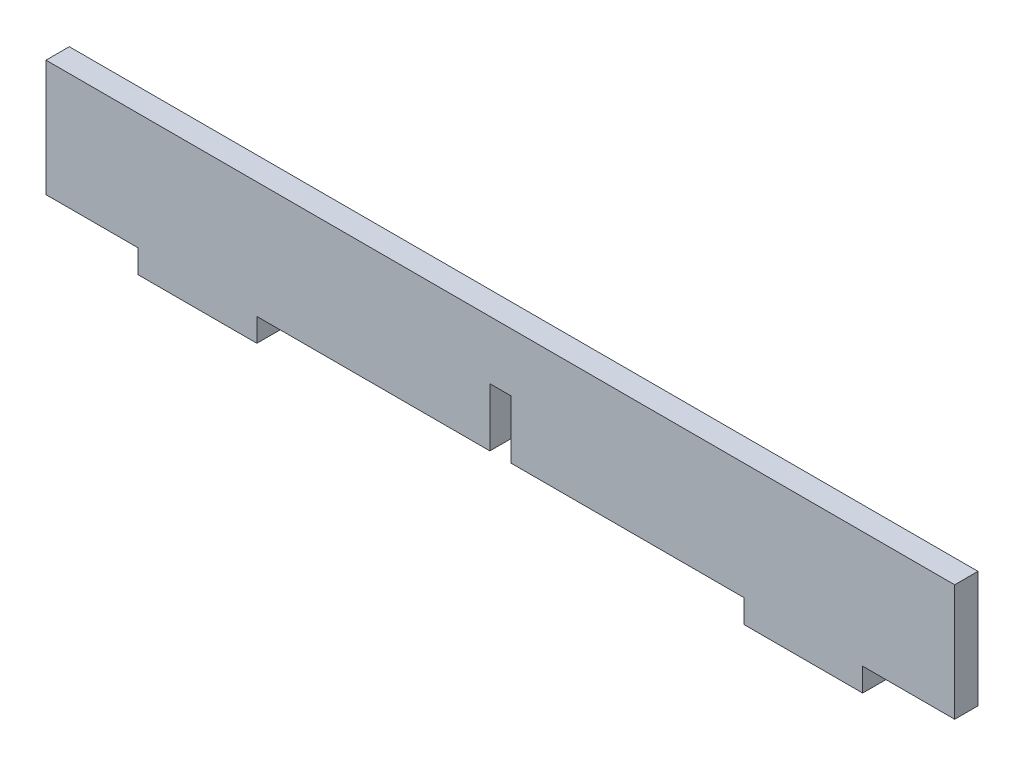
ISO-10303-21;
HEADER;
FILE_DESCRIPTION(('STEP AP214'),'2;1');
FILE_NAME('part.step','',(''),(''),'','','');
FILE_SCHEMA(('AUTOMOTIVE_DESIGN { 1 0 10303 214 1 1 1 1 }'));
ENDSEC;
DATA;
#1=APPLICATION_CONTEXT('core data for automotive mechanical design processes');
#2=APPLICATION_PROTOCOL_DEFINITION('international standard','automotive_design',2000,#1);
#3=PRODUCT_CONTEXT('',#1,'mechanical');
#4=PRODUCT('Part','Part','',(#3));
#5=PRODUCT_RELATED_PRODUCT_CATEGORY('part','',(#4));
#6=PRODUCT_DEFINITION_FORMATION('','',#4);
#7=PRODUCT_DEFINITION_CONTEXT('part definition',#1,'design');
#8=PRODUCT_DEFINITION('design','',#6,#7);
#9=PRODUCT_DEFINITION_SHAPE('','',#8);
#10=(LENGTH_UNIT() NAMED_UNIT(*) SI_UNIT(.MILLI.,.METRE.));
#11=(NAMED_UNIT(*) PLANE_ANGLE_UNIT() SI_UNIT($,.RADIAN.));
#12=(NAMED_UNIT(*) SI_UNIT($,.STERADIAN.) SOLID_ANGLE_UNIT());
#13=UNCERTAINTY_MEASURE_WITH_UNIT(LENGTH_MEASURE(1.E-05),#10,'distance_accuracy_value','');
#14=(GEOMETRIC_REPRESENTATION_CONTEXT(3) GLOBAL_UNCERTAINTY_ASSIGNED_CONTEXT((#13)) GLOBAL_UNIT_ASSIGNED_CONTEXT((#10,
#11,#12)) REPRESENTATION_CONTEXT('',''));
#15=CARTESIAN_POINT('',(0.,0.,0.));
#16=DIRECTION('',(0.,0.,1.));
#17=DIRECTION('',(1.,0.,0.));
#18=AXIS2_PLACEMENT_3D('',#15,#16,#17);
#19=CARTESIAN_POINT('',(-39.,2.,2.));
#20=DIRECTION('',(1.,0.,0.));
#21=DIRECTION('',(0.,0.,-1.));
#22=AXIS2_PLACEMENT_3D('',#19,#20,#21);
#23=PLANE('',#22);
#24=DIRECTION('',(0.,-1.,0.));
#25=VECTOR('',#24,1.);
#26=CARTESIAN_POINT('',(-39.,2.,0.));
#27=LINE('',#26,#25);
#28=CARTESIAN_POINT('',(-39.,12.,0.));
#29=VERTEX_POINT('',#28);
#30=CARTESIAN_POINT('',(-39.,2.,0.));
#31=VERTEX_POINT('',#30);
#32=EDGE_CURVE('E177',#29,#31,#27,.T.);
#33=ORIENTED_EDGE('',*,*,#32,.T.);
#34=DIRECTION('',(0.,0.,-1.));
#35=VECTOR('',#34,1.);
#36=CARTESIAN_POINT('',(-39.,2.,2.));
#37=LINE('',#36,#35);
#38=CARTESIAN_POINT('',(-39.,2.,2.));
#39=VERTEX_POINT('',#38);
#40=EDGE_CURVE('E11',#39,#31,#37,.T.);
#41=ORIENTED_EDGE('',*,*,#40,.F.);
#42=DIRECTION('',(0.,-1.,0.));
#43=VECTOR('',#42,1.);
#44=CARTESIAN_POINT('',(-39.,2.,2.));
#45=LINE('',#44,#43);
#46=CARTESIAN_POINT('',(-39.,12.,2.));
#47=VERTEX_POINT('',#46);
#48=EDGE_CURVE('E207',#47,#39,#45,.T.);
#49=ORIENTED_EDGE('',*,*,#48,.F.);
#50=DIRECTION('',(0.,0.,-1.));
#51=VECTOR('',#50,1.);
#52=CARTESIAN_POINT('',(-39.,12.,2.));
#53=LINE('',#52,#51);
#54=EDGE_CURVE('E173',#47,#29,#53,.T.);
#55=ORIENTED_EDGE('',*,*,#54,.T.);
#56=EDGE_LOOP('',(#33,#41,#49,#55));
#57=FACE_BOUND('',#56,.T.);
#58=ADVANCED_FACE('F33',(#57),#23,.F.);
#59=CARTESIAN_POINT('',(-39.,2.,2.));
#60=DIRECTION('',(0.,1.,0.));
#61=DIRECTION('',(-1.,0.,0.));
#62=AXIS2_PLACEMENT_3D('',#59,#60,#61);
#63=PLANE('',#62);
#64=DIRECTION('',(1.,0.,0.));
#65=VECTOR('',#64,1.);
#66=CARTESIAN_POINT('',(-39.,2.,0.));
#67=LINE('',#66,#65);
#68=CARTESIAN_POINT('',(-31.1,2.,0.));
#69=VERTEX_POINT('',#68);
#70=EDGE_CURVE('E180',#31,#69,#67,.T.);
#71=ORIENTED_EDGE('',*,*,#70,.T.);
#72=DIRECTION('',(0.,0.,-1.));
#73=VECTOR('',#72,1.);
#74=CARTESIAN_POINT('',(-31.1,2.,2.));
#75=LINE('',#74,#73);
#76=CARTESIAN_POINT('',(-31.1,2.,2.));
#77=VERTEX_POINT('',#76);
#78=EDGE_CURVE('E41',#77,#69,#75,.T.);
#79=ORIENTED_EDGE('',*,*,#78,.F.);
#80=DIRECTION('',(1.,0.,0.));
#81=VECTOR('',#80,1.);
#82=CARTESIAN_POINT('',(-39.,2.,2.));
#83=LINE('',#82,#81);
#84=EDGE_CURVE('E116',#39,#77,#83,.T.);
#85=ORIENTED_EDGE('',*,*,#84,.F.);
#86=ORIENTED_EDGE('',*,*,#40,.T.);
#87=EDGE_LOOP('',(#71,#79,#85,#86));
#88=FACE_BOUND('',#87,.T.);
#89=ADVANCED_FACE('F305',(#88),#63,.F.);
#90=CARTESIAN_POINT('',(-31.1,2.,2.));
#91=DIRECTION('',(1.,0.,0.));
#92=DIRECTION('',(0.,0.,-1.));
#93=AXIS2_PLACEMENT_3D('',#90,#91,#92);
#94=PLANE('',#93);
#95=DIRECTION('',(0.,-1.,0.));
#96=VECTOR('',#95,1.);
#97=CARTESIAN_POINT('',(-31.1,2.,0.));
#98=LINE('',#97,#96);
#99=CARTESIAN_POINT('',(-31.1,0.,0.));
#100=VERTEX_POINT('',#99);
#101=EDGE_CURVE('E182',#69,#100,#98,.T.);
#102=ORIENTED_EDGE('',*,*,#101,.T.);
#103=DIRECTION('',(0.,0.,-1.));
#104=VECTOR('',#103,1.);
#105=CARTESIAN_POINT('',(-31.1,0.,2.));
#106=LINE('',#105,#104);
#107=CARTESIAN_POINT('',(-31.1,0.,2.));
#108=VERTEX_POINT('',#107);
#109=EDGE_CURVE('E238',#108,#100,#106,.T.);
#110=ORIENTED_EDGE('',*,*,#109,.F.);
#111=DIRECTION('',(0.,-1.,0.));
#112=VECTOR('',#111,1.);
#113=CARTESIAN_POINT('',(-31.1,2.,2.));
#114=LINE('',#113,#112);
#115=EDGE_CURVE('E246',#77,#108,#114,.T.);
#116=ORIENTED_EDGE('',*,*,#115,.F.);
#117=ORIENTED_EDGE('',*,*,#78,.T.);
#118=EDGE_LOOP('',(#102,#110,#116,#117));
#119=FACE_BOUND('',#118,.T.);
#120=ADVANCED_FACE('F244',(#119),#94,.F.);
#121=CARTESIAN_POINT('',(-20.9,0.,2.));
#122=DIRECTION('',(0.,1.,0.));
#123=DIRECTION('',(-1.,0.,0.));
#124=AXIS2_PLACEMENT_3D('',#121,#122,#123);
#125=PLANE('',#124);
#126=DIRECTION('',(1.,0.,0.));
#127=VECTOR('',#126,1.);
#128=CARTESIAN_POINT('',(-20.9,0.,0.));
#129=LINE('',#128,#127);
#130=CARTESIAN_POINT('',(-20.9,0.,0.));
#131=VERTEX_POINT('',#130);
#132=EDGE_CURVE('E184',#100,#131,#129,.T.);
#133=ORIENTED_EDGE('',*,*,#132,.T.);
#134=DIRECTION('',(0.,0.,-1.));
#135=VECTOR('',#134,1.);
#136=CARTESIAN_POINT('',(-20.9,0.,2.));
#137=LINE('',#136,#135);
#138=CARTESIAN_POINT('',(-20.9,0.,2.));
#139=VERTEX_POINT('',#138);
#140=EDGE_CURVE('E235',#139,#131,#137,.T.);
#141=ORIENTED_EDGE('',*,*,#140,.F.);
#142=DIRECTION('',(1.,0.,0.));
#143=VECTOR('',#142,1.);
#144=CARTESIAN_POINT('',(-20.9,0.,2.));
#145=LINE('',#144,#143);
#146=EDGE_CURVE('E264',#108,#139,#145,.T.);
#147=ORIENTED_EDGE('',*,*,#146,.F.);
#148=ORIENTED_EDGE('',*,*,#109,.T.);
#149=EDGE_LOOP('',(#133,#141,#147,#148));
#150=FACE_BOUND('',#149,.T.);
#151=ADVANCED_FACE('F255',(#150),#125,.F.);
#152=CARTESIAN_POINT('',(-20.9,2.,2.));
#153=DIRECTION('',(-1.,0.,0.));
#154=DIRECTION('',(0.,0.,1.));
#155=AXIS2_PLACEMENT_3D('',#152,#153,#154);
#156=PLANE('',#155);
#157=DIRECTION('',(0.,1.,0.));
#158=VECTOR('',#157,1.);
#159=CARTESIAN_POINT('',(-20.9,2.,0.));
#160=LINE('',#159,#158);
#161=CARTESIAN_POINT('',(-20.9,2.,0.));
#162=VERTEX_POINT('',#161);
#163=EDGE_CURVE('E186',#131,#162,#160,.T.);
#164=ORIENTED_EDGE('',*,*,#163,.T.);
#165=DIRECTION('',(0.,0.,-1.));
#166=VECTOR('',#165,1.);
#167=CARTESIAN_POINT('',(-20.9,2.,2.));
#168=LINE('',#167,#166);
#169=CARTESIAN_POINT('',(-20.9,2.,2.));
#170=VERTEX_POINT('',#169);
#171=EDGE_CURVE('E232',#170,#162,#168,.T.);
#172=ORIENTED_EDGE('',*,*,#171,.F.);
#173=DIRECTION('',(0.,1.,0.));
#174=VECTOR('',#173,1.);
#175=CARTESIAN_POINT('',(-20.9,2.,2.));
#176=LINE('',#175,#174);
#177=EDGE_CURVE('E261',#139,#170,#176,.T.);
#178=ORIENTED_EDGE('',*,*,#177,.F.);
#179=ORIENTED_EDGE('',*,*,#140,.T.);
#180=EDGE_LOOP('',(#164,#172,#178,#179));
#181=FACE_BOUND('',#180,.T.);
#182=ADVANCED_FACE('F259',(#181),#156,.F.);
#183=CARTESIAN_POINT('',(-20.9,2.,2.));
#184=DIRECTION('',(0.,1.,0.));
#185=DIRECTION('',(0.,0.,1.));
#186=AXIS2_PLACEMENT_3D('',#183,#184,#185);
#187=PLANE('',#186);
#188=DIRECTION('',(1.,0.,0.));
#189=VECTOR('',#188,1.);
#190=CARTESIAN_POINT('',(-20.9,2.,0.));
#191=LINE('',#190,#189);
#192=CARTESIAN_POINT('',(-0.9,2.,0.));
#193=VERTEX_POINT('',#192);
#194=EDGE_CURVE('E188',#162,#193,#191,.T.);
#195=ORIENTED_EDGE('',*,*,#194,.T.);
#196=DIRECTION('',(0.,0.,-1.));
#197=VECTOR('',#196,1.);
#198=CARTESIAN_POINT('',(-0.9,2.,2.));
#199=LINE('',#198,#197);
#200=CARTESIAN_POINT('',(-0.9,2.,2.));
#201=VERTEX_POINT('',#200);
#202=EDGE_CURVE('E229',#201,#193,#199,.T.);
#203=ORIENTED_EDGE('',*,*,#202,.F.);
#204=DIRECTION('',(1.,0.,0.));
#205=VECTOR('',#204,1.);
#206=CARTESIAN_POINT('',(-20.9,2.,2.));
#207=LINE('',#206,#205);
#208=EDGE_CURVE('E263',#170,#201,#207,.T.);
#209=ORIENTED_EDGE('',*,*,#208,.F.);
#210=ORIENTED_EDGE('',*,*,#171,.T.);
#211=EDGE_LOOP('',(#195,#203,#209,#210));
#212=FACE_BOUND('',#211,.T.);
#213=ADVANCED_FACE('F318',(#212),#187,.F.);
#214=CARTESIAN_POINT('',(-0.9,2.,2.));
#215=DIRECTION('',(-1.,0.,0.));
#216=DIRECTION('',(0.,0.,1.));
#217=AXIS2_PLACEMENT_3D('',#214,#215,#216);
#218=PLANE('',#217);
#219=DIRECTION('',(0.,1.,0.));
#220=VECTOR('',#219,1.);
#221=CARTESIAN_POINT('',(-0.9,2.,0.));
#222=LINE('',#221,#220);
#223=CARTESIAN_POINT('',(-0.9,6.99999999999999,0.));
#224=VERTEX_POINT('',#223);
#225=EDGE_CURVE('E190',#193,#224,#222,.T.);
#226=ORIENTED_EDGE('',*,*,#225,.T.);
#227=DIRECTION('',(0.,0.,-1.));
#228=VECTOR('',#227,1.);
#229=CARTESIAN_POINT('',(-0.9,6.99999999999999,2.));
#230=LINE('',#229,#228);
#231=CARTESIAN_POINT('',(-0.9,6.99999999999999,2.));
#232=VERTEX_POINT('',#231);
#233=EDGE_CURVE('E226',#232,#224,#230,.T.);
#234=ORIENTED_EDGE('',*,*,#233,.F.);
#235=DIRECTION('',(0.,1.,0.));
#236=VECTOR('',#235,1.);
#237=CARTESIAN_POINT('',(-0.9,2.,2.));
#238=LINE('',#237,#236);
#239=EDGE_CURVE('E266',#201,#232,#238,.T.);
#240=ORIENTED_EDGE('',*,*,#239,.F.);
#241=ORIENTED_EDGE('',*,*,#202,.T.);
#242=EDGE_LOOP('',(#226,#234,#240,#241));
#243=FACE_BOUND('',#242,.T.);
#244=ADVANCED_FACE('F321',(#243),#218,.F.);
#245=CARTESIAN_POINT('',(-0.9,6.99999999999999,2.));
#246=DIRECTION('',(0.,1.,0.));
#247=DIRECTION('',(0.,0.,1.));
#248=AXIS2_PLACEMENT_3D('',#245,#246,#247);
#249=PLANE('',#248);
#250=DIRECTION('',(1.,0.,0.));
#251=VECTOR('',#250,1.);
#252=CARTESIAN_POINT('',(-0.9,6.99999999999999,0.));
#253=LINE('',#252,#251);
#254=CARTESIAN_POINT('',(0.9,6.99999999999999,0.));
#255=VERTEX_POINT('',#254);
#256=EDGE_CURVE('E192',#224,#255,#253,.T.);
#257=ORIENTED_EDGE('',*,*,#256,.T.);
#258=DIRECTION('',(0.,0.,-1.));
#259=VECTOR('',#258,1.);
#260=CARTESIAN_POINT('',(0.9,6.99999999999999,2.));
#261=LINE('',#260,#259);
#262=CARTESIAN_POINT('',(0.9,6.99999999999999,2.));
#263=VERTEX_POINT('',#262);
#264=EDGE_CURVE('E223',#263,#255,#261,.T.);
#265=ORIENTED_EDGE('',*,*,#264,.F.);
#266=DIRECTION('',(1.,0.,0.));
#267=VECTOR('',#266,1.);
#268=CARTESIAN_POINT('',(-0.9,6.99999999999999,2.));
#269=LINE('',#268,#267);
#270=EDGE_CURVE('E272',#232,#263,#269,.T.);
#271=ORIENTED_EDGE('',*,*,#270,.F.);
#272=ORIENTED_EDGE('',*,*,#233,.T.);
#273=EDGE_LOOP('',(#257,#265,#271,#272));
#274=FACE_BOUND('',#273,.T.);
#275=ADVANCED_FACE('F325',(#274),#249,.F.);
#276=CARTESIAN_POINT('',(0.9,2.,2.));
#277=DIRECTION('',(1.,0.,0.));
#278=DIRECTION('',(0.,0.,-1.));
#279=AXIS2_PLACEMENT_3D('',#276,#277,#278);
#280=PLANE('',#279);
#281=DIRECTION('',(0.,-1.,0.));
#282=VECTOR('',#281,1.);
#283=CARTESIAN_POINT('',(0.9,2.,0.));
#284=LINE('',#283,#282);
#285=CARTESIAN_POINT('',(0.9,2.,0.));
#286=VERTEX_POINT('',#285);
#287=EDGE_CURVE('E194',#255,#286,#284,.T.);
#288=ORIENTED_EDGE('',*,*,#287,.T.);
#289=DIRECTION('',(0.,0.,-1.));
#290=VECTOR('',#289,1.);
#291=CARTESIAN_POINT('',(0.9,2.,2.));
#292=LINE('',#291,#290);
#293=CARTESIAN_POINT('',(0.9,2.,2.));
#294=VERTEX_POINT('',#293);
#295=EDGE_CURVE('E220',#294,#286,#292,.T.);
#296=ORIENTED_EDGE('',*,*,#295,.F.);
#297=DIRECTION('',(0.,-1.,0.));
#298=VECTOR('',#297,1.);
#299=CARTESIAN_POINT('',(0.9,2.,2.));
#300=LINE('',#299,#298);
#301=EDGE_CURVE('E274',#263,#294,#300,.T.);
#302=ORIENTED_EDGE('',*,*,#301,.F.);
#303=ORIENTED_EDGE('',*,*,#264,.T.);
#304=EDGE_LOOP('',(#288,#296,#302,#303));
#305=FACE_BOUND('',#304,.T.);
#306=ADVANCED_FACE('F329',(#305),#280,.F.);
#307=CARTESIAN_POINT('',(0.9,2.,2.));
#308=DIRECTION('',(0.,1.,0.));
#309=DIRECTION('',(0.,0.,1.));
#310=AXIS2_PLACEMENT_3D('',#307,#308,#309);
#311=PLANE('',#310);
#312=DIRECTION('',(1.,0.,0.));
#313=VECTOR('',#312,1.);
#314=CARTESIAN_POINT('',(0.9,2.,0.));
#315=LINE('',#314,#313);
#316=CARTESIAN_POINT('',(20.9,2.,0.));
#317=VERTEX_POINT('',#316);
#318=EDGE_CURVE('E196',#286,#317,#315,.T.);
#319=ORIENTED_EDGE('',*,*,#318,.T.);
#320=DIRECTION('',(0.,0.,-1.));
#321=VECTOR('',#320,1.);
#322=CARTESIAN_POINT('',(20.9,2.,2.));
#323=LINE('',#322,#321);
#324=CARTESIAN_POINT('',(20.9,2.,2.));
#325=VERTEX_POINT('',#324);
#326=EDGE_CURVE('E217',#325,#317,#323,.T.);
#327=ORIENTED_EDGE('',*,*,#326,.F.);
#328=DIRECTION('',(1.,0.,0.));
#329=VECTOR('',#328,1.);
#330=CARTESIAN_POINT('',(0.9,2.,2.));
#331=LINE('',#330,#329);
#332=EDGE_CURVE('E276',#294,#325,#331,.T.);
#333=ORIENTED_EDGE('',*,*,#332,.F.);
#334=ORIENTED_EDGE('',*,*,#295,.T.);
#335=EDGE_LOOP('',(#319,#327,#333,#334));
#336=FACE_BOUND('',#335,.T.);
#337=ADVANCED_FACE('F333',(#336),#311,.F.);
#338=CARTESIAN_POINT('',(20.9,2.,2.));
#339=DIRECTION('',(1.,0.,0.));
#340=DIRECTION('',(0.,0.,-1.));
#341=AXIS2_PLACEMENT_3D('',#338,#339,#340);
#342=PLANE('',#341);
#343=DIRECTION('',(0.,-1.,0.));
#344=VECTOR('',#343,1.);
#345=CARTESIAN_POINT('',(20.9,2.,0.));
#346=LINE('',#345,#344);
#347=CARTESIAN_POINT('',(20.9,0.,0.));
#348=VERTEX_POINT('',#347);
#349=EDGE_CURVE('E198',#317,#348,#346,.T.);
#350=ORIENTED_EDGE('',*,*,#349,.T.);
#351=DIRECTION('',(0.,0.,-1.));
#352=VECTOR('',#351,1.);
#353=CARTESIAN_POINT('',(20.9,0.,2.));
#354=LINE('',#353,#352);
#355=CARTESIAN_POINT('',(20.9,0.,2.));
#356=VERTEX_POINT('',#355);
#357=EDGE_CURVE('E214',#356,#348,#354,.T.);
#358=ORIENTED_EDGE('',*,*,#357,.F.);
#359=DIRECTION('',(0.,-1.,0.));
#360=VECTOR('',#359,1.);
#361=CARTESIAN_POINT('',(20.9,2.,2.));
#362=LINE('',#361,#360);
#363=EDGE_CURVE('E278',#325,#356,#362,.T.);
#364=ORIENTED_EDGE('',*,*,#363,.F.);
#365=ORIENTED_EDGE('',*,*,#326,.T.);
#366=EDGE_LOOP('',(#350,#358,#364,#365));
#367=FACE_BOUND('',#366,.T.);
#368=ADVANCED_FACE('F337',(#367),#342,.F.);
#369=CARTESIAN_POINT('',(31.1,0.,2.));
#370=DIRECTION('',(0.,1.,0.));
#371=DIRECTION('',(-1.,0.,0.));
#372=AXIS2_PLACEMENT_3D('',#369,#370,#371);
#373=PLANE('',#372);
#374=DIRECTION('',(1.,0.,0.));
#375=VECTOR('',#374,1.);
#376=CARTESIAN_POINT('',(31.1,0.,0.));
#377=LINE('',#376,#375);
#378=CARTESIAN_POINT('',(31.1,0.,0.));
#379=VERTEX_POINT('',#378);
#380=EDGE_CURVE('E200',#348,#379,#377,.T.);
#381=ORIENTED_EDGE('',*,*,#380,.T.);
#382=DIRECTION('',(0.,0.,-1.));
#383=VECTOR('',#382,1.);
#384=CARTESIAN_POINT('',(31.1,0.,2.));
#385=LINE('',#384,#383);
#386=CARTESIAN_POINT('',(31.1,0.,2.));
#387=VERTEX_POINT('',#386);
#388=EDGE_CURVE('E211',#387,#379,#385,.T.);
#389=ORIENTED_EDGE('',*,*,#388,.F.);
#390=DIRECTION('',(1.,0.,0.));
#391=VECTOR('',#390,1.);
#392=CARTESIAN_POINT('',(31.1,0.,2.));
#393=LINE('',#392,#391);
#394=EDGE_CURVE('E280',#356,#387,#393,.T.);
#395=ORIENTED_EDGE('',*,*,#394,.F.);
#396=ORIENTED_EDGE('',*,*,#357,.T.);
#397=EDGE_LOOP('',(#381,#389,#395,#396));
#398=FACE_BOUND('',#397,.T.);
#399=ADVANCED_FACE('F286',(#398),#373,.F.);
#400=CARTESIAN_POINT('',(31.1,2.,2.));
#401=DIRECTION('',(-1.,0.,0.));
#402=DIRECTION('',(0.,0.,1.));
#403=AXIS2_PLACEMENT_3D('',#400,#401,#402);
#404=PLANE('',#403);
#405=DIRECTION('',(0.,1.,0.));
#406=VECTOR('',#405,1.);
#407=CARTESIAN_POINT('',(31.1,2.,0.));
#408=LINE('',#407,#406);
#409=CARTESIAN_POINT('',(31.1,2.,0.));
#410=VERTEX_POINT('',#409);
#411=EDGE_CURVE('E202',#379,#410,#408,.T.);
#412=ORIENTED_EDGE('',*,*,#411,.T.);
#413=DIRECTION('',(0.,0.,-1.));
#414=VECTOR('',#413,1.);
#415=CARTESIAN_POINT('',(31.1,2.,2.));
#416=LINE('',#415,#414);
#417=CARTESIAN_POINT('',(31.1,2.,2.));
#418=VERTEX_POINT('',#417);
#419=EDGE_CURVE('E168',#418,#410,#416,.T.);
#420=ORIENTED_EDGE('',*,*,#419,.F.);
#421=DIRECTION('',(0.,1.,0.));
#422=VECTOR('',#421,1.);
#423=CARTESIAN_POINT('',(31.1,2.,2.));
#424=LINE('',#423,#422);
#425=EDGE_CURVE('E159',#387,#418,#424,.T.);
#426=ORIENTED_EDGE('',*,*,#425,.F.);
#427=ORIENTED_EDGE('',*,*,#388,.T.);
#428=EDGE_LOOP('',(#412,#420,#426,#427));
#429=FACE_BOUND('',#428,.T.);
#430=ADVANCED_FACE('F290',(#429),#404,.F.);
#431=CARTESIAN_POINT('',(31.1,2.,2.));
#432=DIRECTION('',(0.,1.,0.));
#433=DIRECTION('',(-1.,0.,0.));
#434=AXIS2_PLACEMENT_3D('',#431,#432,#433);
#435=PLANE('',#434);
#436=DIRECTION('',(1.,0.,0.));
#437=VECTOR('',#436,1.);
#438=CARTESIAN_POINT('',(31.1,2.,0.));
#439=LINE('',#438,#437);
#440=CARTESIAN_POINT('',(39.,2.,0.));
#441=VERTEX_POINT('',#440);
#442=EDGE_CURVE('E167',#410,#441,#439,.T.);
#443=ORIENTED_EDGE('',*,*,#442,.T.);
#444=DIRECTION('',(0.,0.,-1.));
#445=VECTOR('',#444,1.);
#446=CARTESIAN_POINT('',(39.,2.,2.));
#447=LINE('',#446,#445);
#448=CARTESIAN_POINT('',(39.,2.,2.));
#449=VERTEX_POINT('',#448);
#450=EDGE_CURVE('E164',#449,#441,#447,.T.);
#451=ORIENTED_EDGE('',*,*,#450,.F.);
#452=DIRECTION('',(1.,0.,0.));
#453=VECTOR('',#452,1.);
#454=CARTESIAN_POINT('',(31.1,2.,2.));
#455=LINE('',#454,#453);
#456=EDGE_CURVE('E153',#418,#449,#455,.T.);
#457=ORIENTED_EDGE('',*,*,#456,.F.);
#458=ORIENTED_EDGE('',*,*,#419,.T.);
#459=EDGE_LOOP('',(#443,#451,#457,#458));
#460=FACE_BOUND('',#459,.T.);
#461=ADVANCED_FACE('F165',(#460),#435,.F.);
#462=CARTESIAN_POINT('',(39.,2.,2.));
#463=DIRECTION('',(-1.,0.,0.));
#464=DIRECTION('',(0.,0.,1.));
#465=AXIS2_PLACEMENT_3D('',#462,#463,#464);
#466=PLANE('',#465);
#467=DIRECTION('',(0.,1.,0.));
#468=VECTOR('',#467,1.);
#469=CARTESIAN_POINT('',(39.,2.,0.));
#470=LINE('',#469,#468);
#471=CARTESIAN_POINT('',(39.,12.,0.));
#472=VERTEX_POINT('',#471);
#473=EDGE_CURVE('E102',#441,#472,#470,.T.);
#474=ORIENTED_EDGE('',*,*,#473,.T.);
#475=DIRECTION('',(0.,0.,-1.));
#476=VECTOR('',#475,1.);
#477=CARTESIAN_POINT('',(39.,12.,2.));
#478=LINE('',#477,#476);
#479=CARTESIAN_POINT('',(39.,12.,2.));
#480=VERTEX_POINT('',#479);
#481=EDGE_CURVE('E169',#480,#472,#478,.T.);
#482=ORIENTED_EDGE('',*,*,#481,.F.);
#483=DIRECTION('',(0.,1.,0.));
#484=VECTOR('',#483,1.);
#485=CARTESIAN_POINT('',(39.,2.,2.));
#486=LINE('',#485,#484);
#487=EDGE_CURVE('E157',#449,#480,#486,.T.);
#488=ORIENTED_EDGE('',*,*,#487,.F.);
#489=ORIENTED_EDGE('',*,*,#450,.T.);
#490=EDGE_LOOP('',(#474,#482,#488,#489));
#491=FACE_BOUND('',#490,.T.);
#492=ADVANCED_FACE('F171',(#491),#466,.F.);
#493=CARTESIAN_POINT('',(-39.,12.,2.));
#494=DIRECTION('',(0.,-1.,0.));
#495=DIRECTION('',(0.,0.,-1.));
#496=AXIS2_PLACEMENT_3D('',#493,#494,#495);
#497=PLANE('',#496);
#498=DIRECTION('',(-1.,0.,0.));
#499=VECTOR('',#498,1.);
#500=CARTESIAN_POINT('',(-39.,12.,0.));
#501=LINE('',#500,#499);
#502=EDGE_CURVE('E108',#472,#29,#501,.T.);
#503=ORIENTED_EDGE('',*,*,#502,.T.);
#504=ORIENTED_EDGE('',*,*,#54,.F.);
#505=DIRECTION('',(-1.,0.,0.));
#506=VECTOR('',#505,1.);
#507=CARTESIAN_POINT('',(-39.,12.,2.));
#508=LINE('',#507,#506);
#509=EDGE_CURVE('E49',#480,#47,#508,.T.);
#510=ORIENTED_EDGE('',*,*,#509,.F.);
#511=ORIENTED_EDGE('',*,*,#481,.T.);
#512=EDGE_LOOP('',(#503,#504,#510,#511));
#513=FACE_BOUND('',#512,.T.);
#514=ADVANCED_FACE('F294',(#513),#497,.F.);
#515=CARTESIAN_POINT('',(0.,0.,2.));
#516=DIRECTION('',(0.,0.,-1.));
#517=DIRECTION('',(-1.,0.,0.));
#518=AXIS2_PLACEMENT_3D('',#515,#516,#517);
#519=PLANE('',#518);
#520=ORIENTED_EDGE('',*,*,#48,.T.);
#521=ORIENTED_EDGE('',*,*,#84,.T.);
#522=ORIENTED_EDGE('',*,*,#115,.T.);
#523=ORIENTED_EDGE('',*,*,#146,.T.);
#524=ORIENTED_EDGE('',*,*,#177,.T.);
#525=ORIENTED_EDGE('',*,*,#208,.T.);
#526=ORIENTED_EDGE('',*,*,#239,.T.);
#527=ORIENTED_EDGE('',*,*,#270,.T.);
#528=ORIENTED_EDGE('',*,*,#301,.T.);
#529=ORIENTED_EDGE('',*,*,#332,.T.);
#530=ORIENTED_EDGE('',*,*,#363,.T.);
#531=ORIENTED_EDGE('',*,*,#394,.T.);
#532=ORIENTED_EDGE('',*,*,#425,.T.);
#533=ORIENTED_EDGE('',*,*,#456,.T.);
#534=ORIENTED_EDGE('',*,*,#487,.T.);
#535=ORIENTED_EDGE('',*,*,#509,.T.);
#536=EDGE_LOOP('',(#520,#521,#522,#523,#524,#525,#526,#527,#528,#529,#530,#531,#532,#533,#534,#535));
#537=FACE_BOUND('',#536,.T.);
#538=ADVANCED_FACE('F155',(#537),#519,.F.);
#539=CARTESIAN_POINT('',(0.,0.,0.));
#540=DIRECTION('',(0.,0.,-1.));
#541=DIRECTION('',(-1.,0.,0.));
#542=AXIS2_PLACEMENT_3D('',#539,#540,#541);
#543=PLANE('',#542);
#544=ORIENTED_EDGE('',*,*,#32,.F.);
#545=ORIENTED_EDGE('',*,*,#502,.F.);
#546=ORIENTED_EDGE('',*,*,#473,.F.);
#547=ORIENTED_EDGE('',*,*,#442,.F.);
#548=ORIENTED_EDGE('',*,*,#411,.F.);
#549=ORIENTED_EDGE('',*,*,#380,.F.);
#550=ORIENTED_EDGE('',*,*,#349,.F.);
#551=ORIENTED_EDGE('',*,*,#318,.F.);
#552=ORIENTED_EDGE('',*,*,#287,.F.);
#553=ORIENTED_EDGE('',*,*,#256,.F.);
#554=ORIENTED_EDGE('',*,*,#225,.F.);
#555=ORIENTED_EDGE('',*,*,#194,.F.);
#556=ORIENTED_EDGE('',*,*,#163,.F.);
#557=ORIENTED_EDGE('',*,*,#132,.F.);
#558=ORIENTED_EDGE('',*,*,#101,.F.);
#559=ORIENTED_EDGE('',*,*,#70,.F.);
#560=EDGE_LOOP('',(#544,#545,#546,#547,#548,#549,#550,#551,#552,#553,#554,#555,#556,#557,#558,#559));
#561=FACE_BOUND('',#560,.T.);
#562=ADVANCED_FACE('F250',(#561),#543,.T.);
#563=CLOSED_SHELL('',(#58,#89,#120,#151,#182,#213,#244,#275,#306,#337,#368,#399,#430,#461,#492,
#514,#538,#562));
#564=MANIFOLD_SOLID_BREP('B2',#563);
#565=ADVANCED_BREP_SHAPE_REPRESENTATION('',(#18,#564),#14);
#566=SHAPE_DEFINITION_REPRESENTATION(#9,#565);
ENDSEC;
END-ISO-10303-21;
